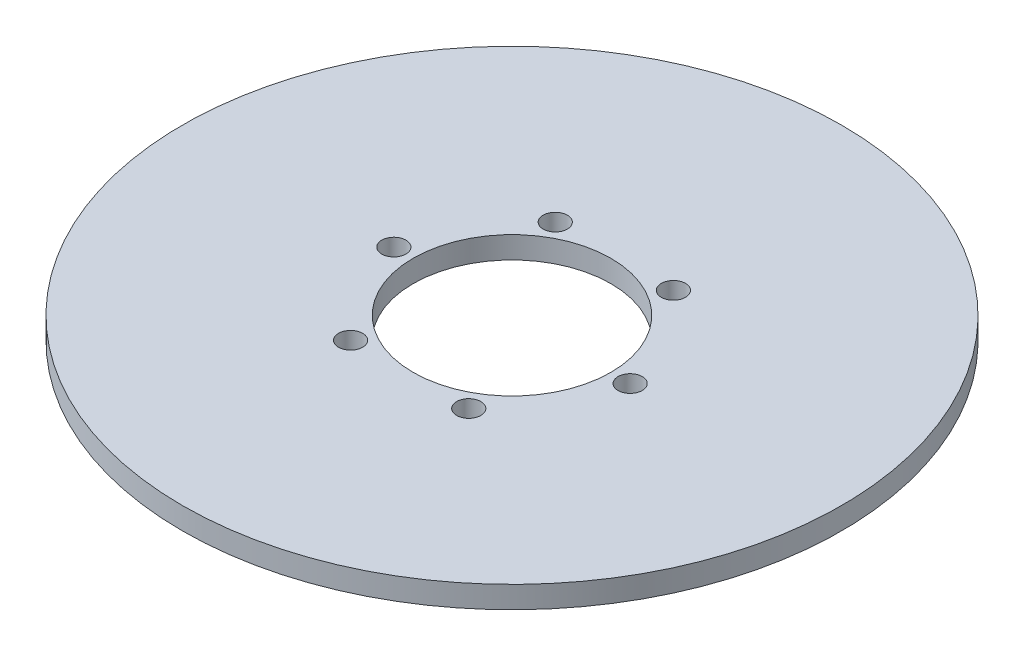
ISO-10303-21;
HEADER;
FILE_DESCRIPTION(('STEP AP214'),'2;1');
FILE_NAME('part.step','',(''),(''),'','','');
FILE_SCHEMA(('AUTOMOTIVE_DESIGN { 1 0 10303 214 1 1 1 1 }'));
ENDSEC;
DATA;
#1=APPLICATION_CONTEXT('core data for automotive mechanical design processes');
#2=APPLICATION_PROTOCOL_DEFINITION('international standard','automotive_design',2000,#1);
#3=PRODUCT_CONTEXT('',#1,'mechanical');
#4=PRODUCT('Part','Part','',(#3));
#5=PRODUCT_RELATED_PRODUCT_CATEGORY('part','',(#4));
#6=PRODUCT_DEFINITION_FORMATION('','',#4);
#7=PRODUCT_DEFINITION_CONTEXT('part definition',#1,'design');
#8=PRODUCT_DEFINITION('design','',#6,#7);
#9=PRODUCT_DEFINITION_SHAPE('','',#8);
#10=(LENGTH_UNIT() NAMED_UNIT(*) SI_UNIT(.MILLI.,.METRE.));
#11=(NAMED_UNIT(*) PLANE_ANGLE_UNIT() SI_UNIT($,.RADIAN.));
#12=(NAMED_UNIT(*) SI_UNIT($,.STERADIAN.) SOLID_ANGLE_UNIT());
#13=UNCERTAINTY_MEASURE_WITH_UNIT(LENGTH_MEASURE(1.E-05),#10,'distance_accuracy_value','');
#14=(GEOMETRIC_REPRESENTATION_CONTEXT(3) GLOBAL_UNCERTAINTY_ASSIGNED_CONTEXT((#13)) GLOBAL_UNIT_ASSIGNED_CONTEXT((#10,
#11,#12)) REPRESENTATION_CONTEXT('',''));
#15=CARTESIAN_POINT('',(0.,0.,0.));
#16=DIRECTION('',(0.,0.,1.));
#17=DIRECTION('',(1.,0.,0.));
#18=AXIS2_PLACEMENT_3D('',#15,#16,#17);
#19=CARTESIAN_POINT('',(0.,5.,0.));
#20=DIRECTION('',(0.,-1.,0.));
#21=DIRECTION('',(0.,0.,-1.));
#22=AXIS2_PLACEMENT_3D('',#19,#20,#21);
#23=CYLINDRICAL_SURFACE('',#22,75.);
#24=CARTESIAN_POINT('',(0.,5.,0.));
#25=DIRECTION('',(0.,1.,0.));
#26=DIRECTION('',(0.,0.,1.));
#27=AXIS2_PLACEMENT_3D('',#24,#25,#26);
#28=CIRCLE('',#27,75.);
#29=CARTESIAN_POINT('',(0.,5.,75.));
#30=VERTEX_POINT('',#29);
#31=EDGE_CURVE('E10',#30,#30,#28,.T.);
#32=ORIENTED_EDGE('',*,*,#31,.F.);
#33=EDGE_LOOP('',(#32));
#34=FACE_BOUND('',#33,.T.);
#35=CARTESIAN_POINT('',(0.,0.,0.));
#36=DIRECTION('',(0.,1.,0.));
#37=DIRECTION('',(0.,0.,1.));
#38=AXIS2_PLACEMENT_3D('',#35,#36,#37);
#39=CIRCLE('',#38,75.);
#40=CARTESIAN_POINT('',(0.,0.,75.));
#41=VERTEX_POINT('',#40);
#42=EDGE_CURVE('E37',#41,#41,#39,.T.);
#43=ORIENTED_EDGE('',*,*,#42,.T.);
#44=EDGE_LOOP('',(#43));
#45=FACE_BOUND('',#44,.T.);
#46=ADVANCED_FACE('F40',(#34,#45),#23,.T.);
#47=CARTESIAN_POINT('',(0.,5.,0.));
#48=DIRECTION('',(0.,1.,0.));
#49=DIRECTION('',(0.,0.,1.));
#50=AXIS2_PLACEMENT_3D('',#47,#48,#49);
#51=PLANE('',#50);
#52=CARTESIAN_POINT('',(-13.4457003277032,5.,-23.2886361109269));
#53=DIRECTION('',(0.,1.,0.));
#54=DIRECTION('',(-0.866025403784433,0.,0.50000000000001));
#55=AXIS2_PLACEMENT_3D('',#52,#53,#54);
#56=CIRCLE('',#55,2.75290012997963);
#57=CARTESIAN_POINT('',(-15.829781774347,5.,-21.912186045937));
#58=VERTEX_POINT('',#57);
#59=EDGE_CURVE('E70',#58,#58,#56,.T.);
#60=ORIENTED_EDGE('',*,*,#59,.F.);
#61=EDGE_LOOP('',(#60));
#62=FACE_BOUND('',#61,.T.);
#63=CARTESIAN_POINT('',(13.4457003277027,5.,-23.2886361109271));
#64=DIRECTION('',(0.,1.,0.));
#65=DIRECTION('',(-0.866025403784443,0.,-0.499999999999992));
#66=AXIS2_PLACEMENT_3D('',#63,#64,#65);
#67=CIRCLE('',#66,2.75290012997963);
#68=CARTESIAN_POINT('',(11.0616188810589,5.,-24.6650861759169));
#69=VERTEX_POINT('',#68);
#70=EDGE_CURVE('E71',#69,#69,#67,.T.);
#71=ORIENTED_EDGE('',*,*,#70,.F.);
#72=EDGE_LOOP('',(#71));
#73=FACE_BOUND('',#72,.T.);
#74=CARTESIAN_POINT('',(26.8914006554059,5.,0.));
#75=DIRECTION('',(0.,1.,0.));
#76=DIRECTION('',(0.,0.,-1.));
#77=AXIS2_PLACEMENT_3D('',#74,#75,#76);
#78=CIRCLE('',#77,2.75290012997963);
#79=CARTESIAN_POINT('',(26.8914006554059,5.,-2.75290012997963));
#80=VERTEX_POINT('',#79);
#81=EDGE_CURVE('E78',#80,#80,#78,.T.);
#82=ORIENTED_EDGE('',*,*,#81,.F.);
#83=EDGE_LOOP('',(#82));
#84=FACE_BOUND('',#83,.T.);
#85=CARTESIAN_POINT('',(13.4457003277031,5.,23.288636110927));
#86=DIRECTION('',(0.,1.,0.));
#87=DIRECTION('',(0.866025403784436,0.,-0.500000000000004));
#88=AXIS2_PLACEMENT_3D('',#85,#86,#87);
#89=CIRCLE('',#88,2.75290012997963);
#90=CARTESIAN_POINT('',(15.8297817743469,5.,21.9121860459371));
#91=VERTEX_POINT('',#90);
#92=EDGE_CURVE('E84',#91,#91,#89,.T.);
#93=ORIENTED_EDGE('',*,*,#92,.F.);
#94=EDGE_LOOP('',(#93));
#95=FACE_BOUND('',#94,.T.);
#96=CARTESIAN_POINT('',(-13.4457003277029,5.,23.2886361109271));
#97=DIRECTION('',(0.,1.,0.));
#98=DIRECTION('',(0.86602540378444,0.,0.499999999999998));
#99=AXIS2_PLACEMENT_3D('',#96,#97,#98);
#100=CIRCLE('',#99,2.75290012997963);
#101=CARTESIAN_POINT('',(-11.0616188810591,5.,24.6650861759169));
#102=VERTEX_POINT('',#101);
#103=EDGE_CURVE('E61',#102,#102,#100,.T.);
#104=ORIENTED_EDGE('',*,*,#103,.F.);
#105=EDGE_LOOP('',(#104));
#106=FACE_BOUND('',#105,.T.);
#107=CARTESIAN_POINT('',(-26.8914006554059,5.,0.));
#108=DIRECTION('',(0.,1.,0.));
#109=DIRECTION('',(0.,0.,1.));
#110=AXIS2_PLACEMENT_3D('',#107,#108,#109);
#111=CIRCLE('',#110,2.75290012997963);
#112=CARTESIAN_POINT('',(-26.8914006554059,5.,2.75290012997963));
#113=VERTEX_POINT('',#112);
#114=EDGE_CURVE('E54',#113,#113,#111,.T.);
#115=ORIENTED_EDGE('',*,*,#114,.F.);
#116=EDGE_LOOP('',(#115));
#117=FACE_BOUND('',#116,.T.);
#118=CARTESIAN_POINT('',(0.,5.,0.));
#119=DIRECTION('',(0.,1.,0.));
#120=DIRECTION('',(0.,0.,1.));
#121=AXIS2_PLACEMENT_3D('',#118,#119,#120);
#122=CIRCLE('',#121,22.5);
#123=CARTESIAN_POINT('',(0.,5.,22.5));
#124=VERTEX_POINT('',#123);
#125=EDGE_CURVE('E50',#124,#124,#122,.T.);
#126=ORIENTED_EDGE('',*,*,#125,.F.);
#127=EDGE_LOOP('',(#126));
#128=FACE_BOUND('',#127,.T.);
#129=ORIENTED_EDGE('',*,*,#31,.T.);
#130=EDGE_LOOP('',(#129));
#131=FACE_BOUND('',#130,.T.);
#132=ADVANCED_FACE('F99',(#62,#73,#84,#95,#106,#117,#128,#131),#51,.T.);
#133=CARTESIAN_POINT('',(0.,0.,0.));
#134=DIRECTION('',(0.,1.,0.));
#135=DIRECTION('',(0.,0.,1.));
#136=AXIS2_PLACEMENT_3D('',#133,#134,#135);
#137=PLANE('',#136);
#138=CARTESIAN_POINT('',(0.,0.,0.));
#139=DIRECTION('',(0.,1.,0.));
#140=DIRECTION('',(0.,0.,1.));
#141=AXIS2_PLACEMENT_3D('',#138,#139,#140);
#142=CIRCLE('',#141,22.5);
#143=CARTESIAN_POINT('',(0.,0.,22.5));
#144=VERTEX_POINT('',#143);
#145=EDGE_CURVE('E47',#144,#144,#142,.T.);
#146=ORIENTED_EDGE('',*,*,#145,.T.);
#147=EDGE_LOOP('',(#146));
#148=FACE_BOUND('',#147,.T.);
#149=ORIENTED_EDGE('',*,*,#42,.F.);
#150=EDGE_LOOP('',(#149));
#151=FACE_BOUND('',#150,.T.);
#152=ADVANCED_FACE('F103',(#148,#151),#137,.F.);
#153=CARTESIAN_POINT('',(0.,5.,0.));
#154=DIRECTION('',(0.,-1.,0.));
#155=DIRECTION('',(0.,0.,-1.));
#156=AXIS2_PLACEMENT_3D('',#153,#154,#155);
#157=CYLINDRICAL_SURFACE('',#156,22.5);
#158=ORIENTED_EDGE('',*,*,#125,.T.);
#159=EDGE_LOOP('',(#158));
#160=FACE_BOUND('',#159,.T.);
#161=ORIENTED_EDGE('',*,*,#145,.F.);
#162=EDGE_LOOP('',(#161));
#163=FACE_BOUND('',#162,.T.);
#164=ADVANCED_FACE('F115',(#160,#163),#157,.F.);
#165=CARTESIAN_POINT('',(-26.8914006554059,0.518290362662165,0.));
#166=DIRECTION('',(0.,1.,0.));
#167=DIRECTION('',(0.,0.,1.));
#168=AXIS2_PLACEMENT_3D('',#165,#166,#167);
#169=CYLINDRICAL_SURFACE('',#168,2.75290012997963);
#170=CARTESIAN_POINT('',(-26.8914006554059,0.518290362662165,0.));
#171=DIRECTION('',(0.,1.,0.));
#172=DIRECTION('',(0.,0.,1.));
#173=AXIS2_PLACEMENT_3D('',#170,#171,#172);
#174=CIRCLE('',#173,2.75290012997963);
#175=CARTESIAN_POINT('',(-26.8914006554059,0.518290362662165,2.75290012997963));
#176=VERTEX_POINT('',#175);
#177=EDGE_CURVE('E55',#176,#176,#174,.T.);
#178=ORIENTED_EDGE('',*,*,#177,.F.);
#179=EDGE_LOOP('',(#178));
#180=FACE_BOUND('',#179,.T.);
#181=ORIENTED_EDGE('',*,*,#114,.T.);
#182=EDGE_LOOP('',(#181));
#183=FACE_BOUND('',#182,.T.);
#184=ADVANCED_FACE('F113',(#180,#183),#169,.F.);
#185=CARTESIAN_POINT('',(-26.8914006554059,0.518290362662165,0.));
#186=DIRECTION('',(0.,1.,0.));
#187=DIRECTION('',(0.,0.,1.));
#188=AXIS2_PLACEMENT_3D('',#185,#186,#187);
#189=PLANE('',#188);
#190=ORIENTED_EDGE('',*,*,#177,.T.);
#191=EDGE_LOOP('',(#190));
#192=FACE_BOUND('',#191,.T.);
#193=ADVANCED_FACE('F144',(#192),#189,.T.);
#194=CARTESIAN_POINT('',(-13.4457003277029,0.518290362662165,23.2886361109271));
#195=DIRECTION('',(0.,1.,0.));
#196=DIRECTION('',(0.,0.,1.));
#197=AXIS2_PLACEMENT_3D('',#194,#195,#196);
#198=CYLINDRICAL_SURFACE('',#197,2.75290012997963);
#199=CARTESIAN_POINT('',(-13.4457003277029,0.518290362662165,23.2886361109271));
#200=DIRECTION('',(0.,1.,0.));
#201=DIRECTION('',(0.86602540378444,0.,0.499999999999998));
#202=AXIS2_PLACEMENT_3D('',#199,#200,#201);
#203=CIRCLE('',#202,2.75290012997963);
#204=CARTESIAN_POINT('',(-11.0616188810591,0.518290362662165,24.6650861759169));
#205=VERTEX_POINT('',#204);
#206=EDGE_CURVE('E59',#205,#205,#203,.T.);
#207=ORIENTED_EDGE('',*,*,#206,.F.);
#208=EDGE_LOOP('',(#207));
#209=FACE_BOUND('',#208,.T.);
#210=ORIENTED_EDGE('',*,*,#103,.T.);
#211=EDGE_LOOP('',(#210));
#212=FACE_BOUND('',#211,.T.);
#213=ADVANCED_FACE('F153',(#209,#212),#198,.F.);
#214=CARTESIAN_POINT('',(-13.4457003277029,0.518290362662165,23.2886361109271));
#215=DIRECTION('',(0.,1.,0.));
#216=DIRECTION('',(0.86602540378444,0.,0.499999999999998));
#217=AXIS2_PLACEMENT_3D('',#214,#215,#216);
#218=PLANE('',#217);
#219=ORIENTED_EDGE('',*,*,#206,.T.);
#220=EDGE_LOOP('',(#219));
#221=FACE_BOUND('',#220,.T.);
#222=ADVANCED_FACE('F96',(#221),#218,.T.);
#223=CARTESIAN_POINT('',(13.4457003277031,0.518290362662165,23.288636110927));
#224=DIRECTION('',(0.,1.,0.));
#225=DIRECTION('',(0.,0.,1.));
#226=AXIS2_PLACEMENT_3D('',#223,#224,#225);
#227=CYLINDRICAL_SURFACE('',#226,2.75290012997963);
#228=CARTESIAN_POINT('',(13.4457003277031,0.518290362662165,23.288636110927));
#229=DIRECTION('',(0.,1.,0.));
#230=DIRECTION('',(0.866025403784436,0.,-0.500000000000004));
#231=AXIS2_PLACEMENT_3D('',#228,#229,#230);
#232=CIRCLE('',#231,2.75290012997963);
#233=CARTESIAN_POINT('',(15.8297817743469,0.518290362662165,21.9121860459371));
#234=VERTEX_POINT('',#233);
#235=EDGE_CURVE('E63',#234,#234,#232,.T.);
#236=ORIENTED_EDGE('',*,*,#235,.F.);
#237=EDGE_LOOP('',(#236));
#238=FACE_BOUND('',#237,.T.);
#239=ORIENTED_EDGE('',*,*,#92,.T.);
#240=EDGE_LOOP('',(#239));
#241=FACE_BOUND('',#240,.T.);
#242=ADVANCED_FACE('F91',(#238,#241),#227,.F.);
#243=CARTESIAN_POINT('',(13.4457003277031,0.518290362662165,23.288636110927));
#244=DIRECTION('',(0.,1.,0.));
#245=DIRECTION('',(0.866025403784436,0.,-0.500000000000004));
#246=AXIS2_PLACEMENT_3D('',#243,#244,#245);
#247=PLANE('',#246);
#248=ORIENTED_EDGE('',*,*,#235,.T.);
#249=EDGE_LOOP('',(#248));
#250=FACE_BOUND('',#249,.T.);
#251=ADVANCED_FACE('F93',(#250),#247,.T.);
#252=CARTESIAN_POINT('',(26.8914006554059,0.518290362662165,0.));
#253=DIRECTION('',(0.,1.,0.));
#254=DIRECTION('',(0.,0.,1.));
#255=AXIS2_PLACEMENT_3D('',#252,#253,#254);
#256=CYLINDRICAL_SURFACE('',#255,2.75290012997963);
#257=CARTESIAN_POINT('',(26.8914006554059,0.518290362662165,0.));
#258=DIRECTION('',(0.,1.,0.));
#259=DIRECTION('',(0.,0.,-1.));
#260=AXIS2_PLACEMENT_3D('',#257,#258,#259);
#261=CIRCLE('',#260,2.75290012997963);
#262=CARTESIAN_POINT('',(26.8914006554059,0.518290362662165,-2.75290012997963));
#263=VERTEX_POINT('',#262);
#264=EDGE_CURVE('E85',#263,#263,#261,.T.);
#265=ORIENTED_EDGE('',*,*,#264,.F.);
#266=EDGE_LOOP('',(#265));
#267=FACE_BOUND('',#266,.T.);
#268=ORIENTED_EDGE('',*,*,#81,.T.);
#269=EDGE_LOOP('',(#268));
#270=FACE_BOUND('',#269,.T.);
#271=ADVANCED_FACE('F187',(#267,#270),#256,.F.);
#272=CARTESIAN_POINT('',(26.8914006554059,0.518290362662165,0.));
#273=DIRECTION('',(0.,1.,0.));
#274=DIRECTION('',(0.,0.,-1.));
#275=AXIS2_PLACEMENT_3D('',#272,#273,#274);
#276=PLANE('',#275);
#277=ORIENTED_EDGE('',*,*,#264,.T.);
#278=EDGE_LOOP('',(#277));
#279=FACE_BOUND('',#278,.T.);
#280=ADVANCED_FACE('F198',(#279),#276,.T.);
#281=CARTESIAN_POINT('',(13.4457003277027,0.518290362662165,-23.2886361109271));
#282=DIRECTION('',(0.,1.,0.));
#283=DIRECTION('',(0.,0.,1.));
#284=AXIS2_PLACEMENT_3D('',#281,#282,#283);
#285=CYLINDRICAL_SURFACE('',#284,2.75290012997963);
#286=CARTESIAN_POINT('',(13.4457003277027,0.518290362662165,-23.2886361109271));
#287=DIRECTION('',(0.,1.,0.));
#288=DIRECTION('',(-0.866025403784443,0.,-0.499999999999992));
#289=AXIS2_PLACEMENT_3D('',#286,#287,#288);
#290=CIRCLE('',#289,2.75290012997963);
#291=CARTESIAN_POINT('',(11.0616188810589,0.518290362662165,-24.6650861759169));
#292=VERTEX_POINT('',#291);
#293=EDGE_CURVE('E76',#292,#292,#290,.T.);
#294=ORIENTED_EDGE('',*,*,#293,.F.);
#295=EDGE_LOOP('',(#294));
#296=FACE_BOUND('',#295,.T.);
#297=ORIENTED_EDGE('',*,*,#70,.T.);
#298=EDGE_LOOP('',(#297));
#299=FACE_BOUND('',#298,.T.);
#300=ADVANCED_FACE('F202',(#296,#299),#285,.F.);
#301=CARTESIAN_POINT('',(13.4457003277027,0.518290362662165,-23.2886361109271));
#302=DIRECTION('',(0.,1.,0.));
#303=DIRECTION('',(-0.866025403784443,0.,-0.499999999999992));
#304=AXIS2_PLACEMENT_3D('',#301,#302,#303);
#305=PLANE('',#304);
#306=ORIENTED_EDGE('',*,*,#293,.T.);
#307=EDGE_LOOP('',(#306));
#308=FACE_BOUND('',#307,.T.);
#309=ADVANCED_FACE('F212',(#308),#305,.T.);
#310=CARTESIAN_POINT('',(-13.4457003277032,0.518290362662165,-23.2886361109269));
#311=DIRECTION('',(0.,1.,0.));
#312=DIRECTION('',(0.,0.,1.));
#313=AXIS2_PLACEMENT_3D('',#310,#311,#312);
#314=CYLINDRICAL_SURFACE('',#313,2.75290012997963);
#315=CARTESIAN_POINT('',(-13.4457003277032,0.518290362662165,-23.2886361109269));
#316=DIRECTION('',(0.,1.,0.));
#317=DIRECTION('',(-0.866025403784433,0.,0.50000000000001));
#318=AXIS2_PLACEMENT_3D('',#315,#316,#317);
#319=CIRCLE('',#318,2.75290012997963);
#320=CARTESIAN_POINT('',(-15.829781774347,0.518290362662165,-21.912186045937));
#321=VERTEX_POINT('',#320);
#322=EDGE_CURVE('E69',#321,#321,#319,.T.);
#323=ORIENTED_EDGE('',*,*,#322,.F.);
#324=EDGE_LOOP('',(#323));
#325=FACE_BOUND('',#324,.T.);
#326=ORIENTED_EDGE('',*,*,#59,.T.);
#327=EDGE_LOOP('',(#326));
#328=FACE_BOUND('',#327,.T.);
#329=ADVANCED_FACE('F224',(#325,#328),#314,.F.);
#330=CARTESIAN_POINT('',(-13.4457003277032,0.518290362662165,-23.2886361109269));
#331=DIRECTION('',(0.,1.,0.));
#332=DIRECTION('',(-0.866025403784433,0.,0.50000000000001));
#333=AXIS2_PLACEMENT_3D('',#330,#331,#332);
#334=PLANE('',#333);
#335=ORIENTED_EDGE('',*,*,#322,.T.);
#336=EDGE_LOOP('',(#335));
#337=FACE_BOUND('',#336,.T.);
#338=ADVANCED_FACE('F235',(#337),#334,.T.);
#339=CLOSED_SHELL('',(#46,#132,#152,#164,#184,#193,#213,#222,#242,#251,#271,#280,#300,#309,#329,#338));
#340=MANIFOLD_SOLID_BREP('B2',#339);
#341=ADVANCED_BREP_SHAPE_REPRESENTATION('',(#18,#340),#14);
#342=SHAPE_DEFINITION_REPRESENTATION(#9,#341);
ENDSEC;
END-ISO-10303-21;
